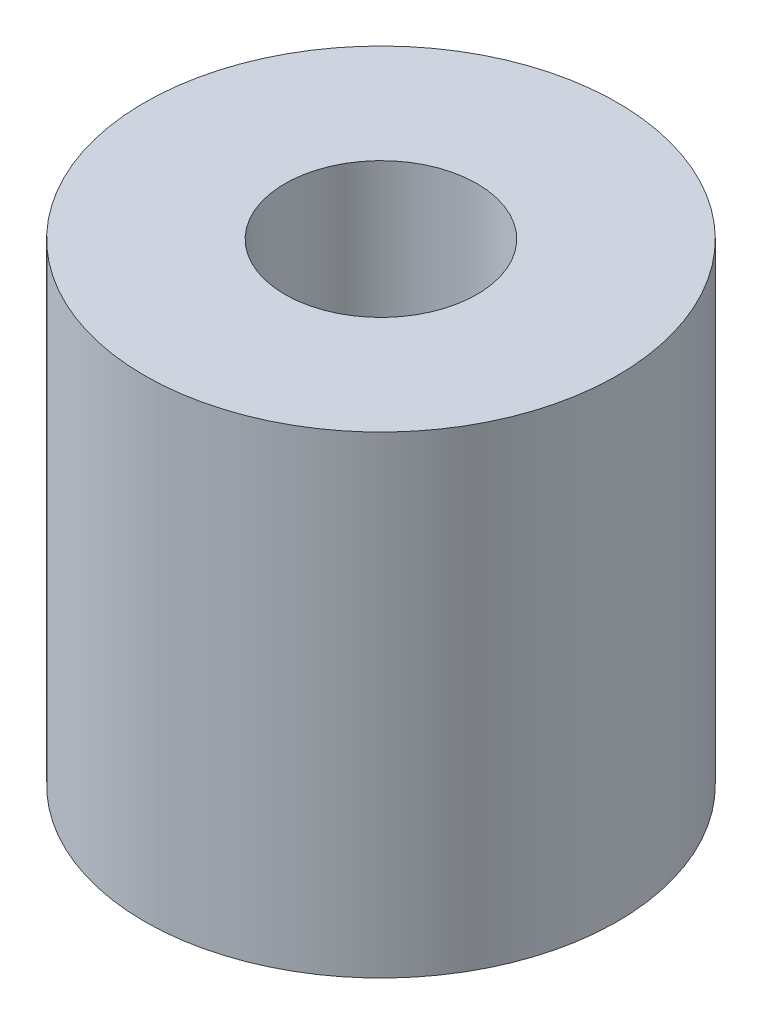
ISO-10303-21;
HEADER;
FILE_DESCRIPTION(('STEP AP214'),'2;1');
FILE_NAME('part.step','',(''),(''),'','','');
FILE_SCHEMA(('AUTOMOTIVE_DESIGN { 1 0 10303 214 1 1 1 1 }'));
ENDSEC;
DATA;
#1=APPLICATION_CONTEXT('core data for automotive mechanical design processes');
#2=APPLICATION_PROTOCOL_DEFINITION('international standard','automotive_design',2000,#1);
#3=PRODUCT_CONTEXT('',#1,'mechanical');
#4=PRODUCT('Part','Part','',(#3));
#5=PRODUCT_RELATED_PRODUCT_CATEGORY('part','',(#4));
#6=PRODUCT_DEFINITION_FORMATION('','',#4);
#7=PRODUCT_DEFINITION_CONTEXT('part definition',#1,'design');
#8=PRODUCT_DEFINITION('design','',#6,#7);
#9=PRODUCT_DEFINITION_SHAPE('','',#8);
#10=(LENGTH_UNIT() NAMED_UNIT(*) SI_UNIT(.MILLI.,.METRE.));
#11=(NAMED_UNIT(*) PLANE_ANGLE_UNIT() SI_UNIT($,.RADIAN.));
#12=(NAMED_UNIT(*) SI_UNIT($,.STERADIAN.) SOLID_ANGLE_UNIT());
#13=UNCERTAINTY_MEASURE_WITH_UNIT(LENGTH_MEASURE(1.E-05),#10,'distance_accuracy_value','');
#14=(GEOMETRIC_REPRESENTATION_CONTEXT(3) GLOBAL_UNCERTAINTY_ASSIGNED_CONTEXT((#13)) GLOBAL_UNIT_ASSIGNED_CONTEXT((#10,
#11,#12)) REPRESENTATION_CONTEXT('',''));
#15=CARTESIAN_POINT('',(0.,0.,0.));
#16=DIRECTION('',(0.,0.,1.));
#17=DIRECTION('',(1.,0.,0.));
#18=AXIS2_PLACEMENT_3D('',#15,#16,#17);
#19=CARTESIAN_POINT('',(0.,8.,0.));
#20=DIRECTION('',(0.,1.,0.));
#21=DIRECTION('',(0.,0.,1.));
#22=AXIS2_PLACEMENT_3D('',#19,#20,#21);
#23=PLANE('',#22);
#24=CARTESIAN_POINT('',(0.,8.,0.));
#25=DIRECTION('',(0.,1.,0.));
#26=DIRECTION('',(0.,0.,1.));
#27=AXIS2_PLACEMENT_3D('',#24,#25,#26);
#28=CIRCLE('',#27,4.);
#29=CARTESIAN_POINT('',(0.,8.,4.));
#30=VERTEX_POINT('',#29);
#31=EDGE_CURVE('E10',#30,#30,#28,.T.);
#32=ORIENTED_EDGE('',*,*,#31,.T.);
#33=EDGE_LOOP('',(#32));
#34=FACE_BOUND('',#33,.T.);
#35=CARTESIAN_POINT('',(0.,8.,0.));
#36=DIRECTION('',(0.,1.,0.));
#37=DIRECTION('',(0.,0.,1.));
#38=AXIS2_PLACEMENT_3D('',#35,#36,#37);
#39=CIRCLE('',#38,1.625);
#40=CARTESIAN_POINT('',(0.,8.,1.625));
#41=VERTEX_POINT('',#40);
#42=EDGE_CURVE('E46',#41,#41,#39,.T.);
#43=ORIENTED_EDGE('',*,*,#42,.F.);
#44=EDGE_LOOP('',(#43));
#45=FACE_BOUND('',#44,.T.);
#46=ADVANCED_FACE('F35',(#34,#45),#23,.T.);
#47=CARTESIAN_POINT('',(0.,0.,0.));
#48=DIRECTION('',(0.,1.,0.));
#49=DIRECTION('',(0.,0.,1.));
#50=AXIS2_PLACEMENT_3D('',#47,#48,#49);
#51=PLANE('',#50);
#52=CARTESIAN_POINT('',(0.,0.,0.));
#53=DIRECTION('',(0.,1.,0.));
#54=DIRECTION('',(0.,0.,1.));
#55=AXIS2_PLACEMENT_3D('',#52,#53,#54);
#56=CIRCLE('',#55,4.);
#57=CARTESIAN_POINT('',(0.,0.,4.));
#58=VERTEX_POINT('',#57);
#59=EDGE_CURVE('E39',#58,#58,#56,.T.);
#60=ORIENTED_EDGE('',*,*,#59,.F.);
#61=EDGE_LOOP('',(#60));
#62=FACE_BOUND('',#61,.T.);
#63=CARTESIAN_POINT('',(0.,0.,0.));
#64=DIRECTION('',(0.,1.,0.));
#65=DIRECTION('',(0.,0.,1.));
#66=AXIS2_PLACEMENT_3D('',#63,#64,#65);
#67=CIRCLE('',#66,1.625);
#68=CARTESIAN_POINT('',(0.,0.,1.625));
#69=VERTEX_POINT('',#68);
#70=EDGE_CURVE('E48',#69,#69,#67,.T.);
#71=ORIENTED_EDGE('',*,*,#70,.T.);
#72=EDGE_LOOP('',(#71));
#73=FACE_BOUND('',#72,.T.);
#74=ADVANCED_FACE('F58',(#62,#73),#51,.F.);
#75=CARTESIAN_POINT('',(0.,8.,0.));
#76=DIRECTION('',(0.,-1.,0.));
#77=DIRECTION('',(0.,0.,-1.));
#78=AXIS2_PLACEMENT_3D('',#75,#76,#77);
#79=CYLINDRICAL_SURFACE('',#78,4.);
#80=ORIENTED_EDGE('',*,*,#31,.F.);
#81=EDGE_LOOP('',(#80));
#82=FACE_BOUND('',#81,.T.);
#83=ORIENTED_EDGE('',*,*,#59,.T.);
#84=EDGE_LOOP('',(#83));
#85=FACE_BOUND('',#84,.T.);
#86=ADVANCED_FACE('F37',(#82,#85),#79,.T.);
#87=CARTESIAN_POINT('',(0.,8.,0.));
#88=DIRECTION('',(0.,-1.,0.));
#89=DIRECTION('',(0.,0.,-1.));
#90=AXIS2_PLACEMENT_3D('',#87,#88,#89);
#91=CYLINDRICAL_SURFACE('',#90,1.625);
#92=ORIENTED_EDGE('',*,*,#42,.T.);
#93=EDGE_LOOP('',(#92));
#94=FACE_BOUND('',#93,.T.);
#95=ORIENTED_EDGE('',*,*,#70,.F.);
#96=EDGE_LOOP('',(#95));
#97=FACE_BOUND('',#96,.T.);
#98=ADVANCED_FACE('F54',(#94,#97),#91,.F.);
#99=CLOSED_SHELL('',(#46,#74,#86,#98));
#100=MANIFOLD_SOLID_BREP('B2',#99);
#101=ADVANCED_BREP_SHAPE_REPRESENTATION('',(#18,#100),#14);
#102=SHAPE_DEFINITION_REPRESENTATION(#9,#101);
ENDSEC;
END-ISO-10303-21;
